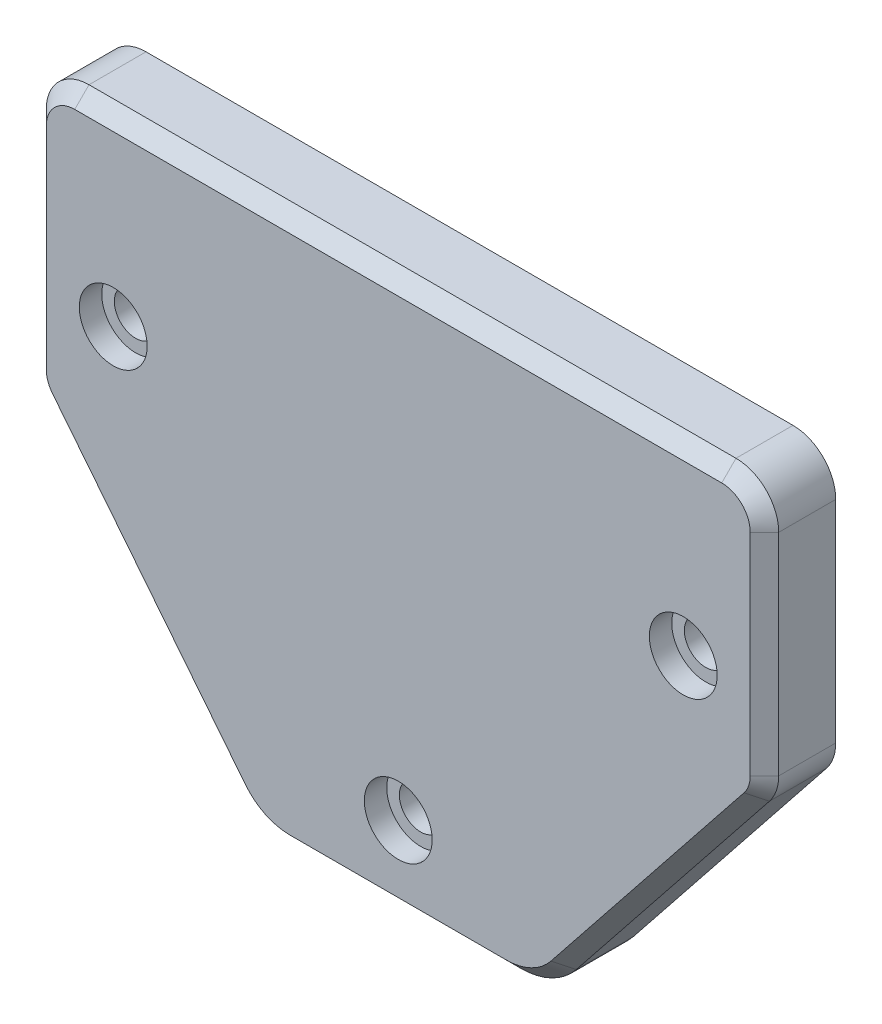
ISO-10303-21;
HEADER;
FILE_DESCRIPTION(('STEP AP214'),'2;1');
FILE_NAME('part.step','',(''),(''),'','','');
FILE_SCHEMA(('AUTOMOTIVE_DESIGN { 1 0 10303 214 1 1 1 1 }'));
ENDSEC;
DATA;
#1=APPLICATION_CONTEXT('core data for automotive mechanical design processes');
#2=APPLICATION_PROTOCOL_DEFINITION('international standard','automotive_design',2000,#1);
#3=PRODUCT_CONTEXT('',#1,'mechanical');
#4=PRODUCT('Part','Part','',(#3));
#5=PRODUCT_RELATED_PRODUCT_CATEGORY('part','',(#4));
#6=PRODUCT_DEFINITION_FORMATION('','',#4);
#7=PRODUCT_DEFINITION_CONTEXT('part definition',#1,'design');
#8=PRODUCT_DEFINITION('design','',#6,#7);
#9=PRODUCT_DEFINITION_SHAPE('','',#8);
#10=(LENGTH_UNIT() NAMED_UNIT(*) SI_UNIT(.MILLI.,.METRE.));
#11=(NAMED_UNIT(*) PLANE_ANGLE_UNIT() SI_UNIT($,.RADIAN.));
#12=(NAMED_UNIT(*) SI_UNIT($,.STERADIAN.) SOLID_ANGLE_UNIT());
#13=UNCERTAINTY_MEASURE_WITH_UNIT(LENGTH_MEASURE(1.E-05),#10,'distance_accuracy_value','');
#14=(GEOMETRIC_REPRESENTATION_CONTEXT(3) GLOBAL_UNCERTAINTY_ASSIGNED_CONTEXT((#13)) GLOBAL_UNIT_ASSIGNED_CONTEXT((#10,
#11,#12)) REPRESENTATION_CONTEXT('',''));
#15=CARTESIAN_POINT('',(0.,0.,0.));
#16=DIRECTION('',(0.,0.,1.));
#17=DIRECTION('',(1.,0.,0.));
#18=AXIS2_PLACEMENT_3D('',#15,#16,#17);
#19=CARTESIAN_POINT('',(-22.7,9.85,5.));
#20=DIRECTION('',(0.,0.,1.));
#21=DIRECTION('',(1.,0.,0.));
#22=AXIS2_PLACEMENT_3D('',#19,#20,#21);
#23=PLANE('',#22);
#24=CARTESIAN_POINT('',(-20.,0.,5.));
#25=DIRECTION('',(0.,0.,1.));
#26=DIRECTION('',(1.,0.,0.));
#27=AXIS2_PLACEMENT_3D('',#24,#25,#26);
#28=CIRCLE('',#27,2.38125);
#29=CARTESIAN_POINT('',(-17.61875,0.,5.));
#30=VERTEX_POINT('',#29);
#31=EDGE_CURVE('E698',#30,#30,#28,.T.);
#32=ORIENTED_EDGE('',*,*,#31,.F.);
#33=EDGE_LOOP('',(#32));
#34=FACE_BOUND('',#33,.T.);
#35=CARTESIAN_POINT('',(20.,0.,5.));
#36=DIRECTION('',(0.,0.,1.));
#37=DIRECTION('',(1.,0.,0.));
#38=AXIS2_PLACEMENT_3D('',#35,#36,#37);
#39=CIRCLE('',#38,2.38125);
#40=CARTESIAN_POINT('',(22.38125,0.,5.));
#41=VERTEX_POINT('',#40);
#42=EDGE_CURVE('E395',#41,#41,#39,.T.);
#43=ORIENTED_EDGE('',*,*,#42,.F.);
#44=EDGE_LOOP('',(#43));
#45=FACE_BOUND('',#44,.T.);
#46=CARTESIAN_POINT('',(0.,-20.,5.));
#47=DIRECTION('',(0.,0.,1.));
#48=DIRECTION('',(1.,0.,0.));
#49=AXIS2_PLACEMENT_3D('',#46,#47,#48);
#50=CIRCLE('',#49,2.38125);
#51=CARTESIAN_POINT('',(2.38125,-20.,5.));
#52=VERTEX_POINT('',#51);
#53=EDGE_CURVE('E390',#52,#52,#50,.T.);
#54=ORIENTED_EDGE('',*,*,#53,.F.);
#55=EDGE_LOOP('',(#54));
#56=FACE_BOUND('',#55,.T.);
#57=DIRECTION('',(0.623241640755491,0.782029319928865,0.));
#58=VECTOR('',#57,1.);
#59=CARTESIAN_POINT('',(24.2640586398577,-6.19727219314287,5.));
#60=LINE('',#59,#58);
#61=CARTESIAN_POINT('',(10.7192666801064,-23.192966563022,5.));
#62=VERTEX_POINT('',#61);
#63=CARTESIAN_POINT('',(24.2640586398577,-6.19727219314287,5.));
#64=VERTEX_POINT('',#63);
#65=EDGE_CURVE('E301',#62,#64,#60,.T.);
#66=ORIENTED_EDGE('',*,*,#65,.T.);
#67=CARTESIAN_POINT('',(22.7,-4.95078891163188,5.));
#68=DIRECTION('',(0.,0.,1.));
#69=DIRECTION('',(1.,0.,0.));
#70=AXIS2_PLACEMENT_3D('',#67,#68,#69);
#71=CIRCLE('',#70,2.00000000000001);
#72=CARTESIAN_POINT('',(24.7,-4.95078891163187,5.));
#73=VERTEX_POINT('',#72);
#74=EDGE_CURVE('E304',#64,#73,#71,.T.);
#75=ORIENTED_EDGE('',*,*,#74,.T.);
#76=DIRECTION('',(0.,1.,0.));
#77=VECTOR('',#76,1.);
#78=CARTESIAN_POINT('',(24.7,9.84999999999998,5.));
#79=LINE('',#78,#77);
#80=CARTESIAN_POINT('',(24.7,9.84999999999998,5.));
#81=VERTEX_POINT('',#80);
#82=EDGE_CURVE('E277',#73,#81,#79,.T.);
#83=ORIENTED_EDGE('',*,*,#82,.T.);
#84=CARTESIAN_POINT('',(22.7,9.85,5.));
#85=DIRECTION('',(0.,0.,1.));
#86=DIRECTION('',(1.,0.,0.));
#87=AXIS2_PLACEMENT_3D('',#84,#85,#86);
#88=CIRCLE('',#87,2.00000000000001);
#89=CARTESIAN_POINT('',(22.7,11.85,5.));
#90=VERTEX_POINT('',#89);
#91=EDGE_CURVE('E274',#81,#90,#88,.T.);
#92=ORIENTED_EDGE('',*,*,#91,.T.);
#93=DIRECTION('',(-1.,0.,0.));
#94=VECTOR('',#93,1.);
#95=CARTESIAN_POINT('',(-22.7,11.85,5.));
#96=LINE('',#95,#94);
#97=CARTESIAN_POINT('',(-22.7,11.85,5.));
#98=VERTEX_POINT('',#97);
#99=EDGE_CURVE('E178',#90,#98,#96,.T.);
#100=ORIENTED_EDGE('',*,*,#99,.T.);
#101=CARTESIAN_POINT('',(-22.7,9.85,5.));
#102=DIRECTION('',(0.,0.,1.));
#103=DIRECTION('',(1.,0.,0.));
#104=AXIS2_PLACEMENT_3D('',#101,#102,#103);
#105=CIRCLE('',#104,2.00000000000001);
#106=CARTESIAN_POINT('',(-24.7,9.84999999999998,5.));
#107=VERTEX_POINT('',#106);
#108=EDGE_CURVE('E280',#98,#107,#105,.T.);
#109=ORIENTED_EDGE('',*,*,#108,.T.);
#110=DIRECTION('',(0.,-1.,0.));
#111=VECTOR('',#110,1.);
#112=CARTESIAN_POINT('',(-24.7,-4.95078891163188,5.));
#113=LINE('',#112,#111);
#114=CARTESIAN_POINT('',(-24.7,-4.95078891163188,5.));
#115=VERTEX_POINT('',#114);
#116=EDGE_CURVE('E283',#107,#115,#113,.T.);
#117=ORIENTED_EDGE('',*,*,#116,.T.);
#118=CARTESIAN_POINT('',(-22.7,-4.95078891163188,5.));
#119=DIRECTION('',(0.,0.,1.));
#120=DIRECTION('',(1.,0.,0.));
#121=AXIS2_PLACEMENT_3D('',#118,#119,#120);
#122=CIRCLE('',#121,2.00000000000001);
#123=CARTESIAN_POINT('',(-24.2640586398577,-6.19727219314287,5.));
#124=VERTEX_POINT('',#123);
#125=EDGE_CURVE('E286',#115,#124,#122,.T.);
#126=ORIENTED_EDGE('',*,*,#125,.T.);
#127=DIRECTION('',(0.623241640755491,-0.782029319928865,0.));
#128=VECTOR('',#127,1.);
#129=CARTESIAN_POINT('',(-10.7192666801064,-23.1929665630219,5.));
#130=LINE('',#129,#128);
#131=CARTESIAN_POINT('',(-10.7192666801064,-23.1929665630219,5.));
#132=VERTEX_POINT('',#131);
#133=EDGE_CURVE('E289',#124,#132,#130,.T.);
#134=ORIENTED_EDGE('',*,*,#133,.T.);
#135=CARTESIAN_POINT('',(-7.59114940039091,-20.7,5.));
#136=DIRECTION('',(0.,0.,1.));
#137=DIRECTION('',(1.,0.,0.));
#138=AXIS2_PLACEMENT_3D('',#135,#136,#137);
#139=CIRCLE('',#138,4.00000000000001);
#140=CARTESIAN_POINT('',(-7.5911494003909,-24.7,5.));
#141=VERTEX_POINT('',#140);
#142=EDGE_CURVE('E292',#132,#141,#139,.T.);
#143=ORIENTED_EDGE('',*,*,#142,.T.);
#144=DIRECTION('',(1.,0.,0.));
#145=VECTOR('',#144,1.);
#146=CARTESIAN_POINT('',(7.59114940039088,-24.7,5.));
#147=LINE('',#146,#145);
#148=CARTESIAN_POINT('',(7.59114940039088,-24.7,5.));
#149=VERTEX_POINT('',#148);
#150=EDGE_CURVE('E295',#141,#149,#147,.T.);
#151=ORIENTED_EDGE('',*,*,#150,.T.);
#152=CARTESIAN_POINT('',(7.59114940039091,-20.7,5.));
#153=DIRECTION('',(0.,0.,1.));
#154=DIRECTION('',(1.,0.,0.));
#155=AXIS2_PLACEMENT_3D('',#152,#153,#154);
#156=CIRCLE('',#155,4.00000000000001);
#157=EDGE_CURVE('E298',#149,#62,#156,.T.);
#158=ORIENTED_EDGE('',*,*,#157,.T.);
#159=EDGE_LOOP('',(#66,#75,#83,#92,#100,#109,#117,#126,#134,#143,#151,#158));
#160=FACE_BOUND('',#159,.T.);
#161=ADVANCED_FACE('F41',(#34,#45,#56,#160),#23,.T.);
#162=CARTESIAN_POINT('',(-22.7,9.85,0.));
#163=DIRECTION('',(0.,0.,1.));
#164=DIRECTION('',(1.,0.,0.));
#165=AXIS2_PLACEMENT_3D('',#162,#163,#164);
#166=PLANE('',#165);
#167=CARTESIAN_POINT('',(-22.7,9.85,0.));
#168=DIRECTION('',(0.,0.,1.));
#169=DIRECTION('',(1.,0.,0.));
#170=AXIS2_PLACEMENT_3D('',#167,#168,#169);
#171=CIRCLE('',#170,3.);
#172=CARTESIAN_POINT('',(-22.7,12.85,0.));
#173=VERTEX_POINT('',#172);
#174=CARTESIAN_POINT('',(-25.7,9.84999999999998,0.));
#175=VERTEX_POINT('',#174);
#176=EDGE_CURVE('E172',#173,#175,#171,.T.);
#177=ORIENTED_EDGE('',*,*,#176,.F.);
#178=DIRECTION('',(-1.,0.,0.));
#179=VECTOR('',#178,1.);
#180=CARTESIAN_POINT('',(0.,12.85,0.));
#181=LINE('',#180,#179);
#182=CARTESIAN_POINT('',(22.7,12.85,0.));
#183=VERTEX_POINT('',#182);
#184=EDGE_CURVE('E182',#183,#173,#181,.T.);
#185=ORIENTED_EDGE('',*,*,#184,.F.);
#186=CARTESIAN_POINT('',(22.7,9.85,0.));
#187=DIRECTION('',(0.,0.,1.));
#188=DIRECTION('',(-1.,0.,0.));
#189=AXIS2_PLACEMENT_3D('',#186,#187,#188);
#190=CIRCLE('',#189,3.);
#191=CARTESIAN_POINT('',(25.7,9.84999999999998,0.));
#192=VERTEX_POINT('',#191);
#193=EDGE_CURVE('E189',#192,#183,#190,.T.);
#194=ORIENTED_EDGE('',*,*,#193,.F.);
#195=DIRECTION('',(0.,1.,0.));
#196=VECTOR('',#195,1.);
#197=CARTESIAN_POINT('',(25.7,-4.95078891163186,0.));
#198=LINE('',#197,#196);
#199=CARTESIAN_POINT('',(25.7,-4.95078891163186,0.));
#200=VERTEX_POINT('',#199);
#201=EDGE_CURVE('E235',#200,#192,#198,.T.);
#202=ORIENTED_EDGE('',*,*,#201,.F.);
#203=CARTESIAN_POINT('',(22.7,-4.95078891163188,0.));
#204=DIRECTION('',(0.,0.,1.));
#205=DIRECTION('',(1.,0.,0.));
#206=AXIS2_PLACEMENT_3D('',#203,#204,#205);
#207=CIRCLE('',#206,3.);
#208=CARTESIAN_POINT('',(25.0460879597866,-6.82051383389836,0.));
#209=VERTEX_POINT('',#208);
#210=EDGE_CURVE('E231',#209,#200,#207,.T.);
#211=ORIENTED_EDGE('',*,*,#210,.F.);
#212=DIRECTION('',(0.623241640755491,0.782029319928865,0.));
#213=VECTOR('',#212,1.);
#214=CARTESIAN_POINT('',(11.5012960000352,-23.8162082037774,0.));
#215=LINE('',#214,#213);
#216=CARTESIAN_POINT('',(11.5012960000352,-23.8162082037774,0.));
#217=VERTEX_POINT('',#216);
#218=EDGE_CURVE('E227',#217,#209,#215,.T.);
#219=ORIENTED_EDGE('',*,*,#218,.F.);
#220=CARTESIAN_POINT('',(7.59114940039091,-20.7,0.));
#221=DIRECTION('',(0.,0.,1.));
#222=DIRECTION('',(-1.,0.,0.));
#223=AXIS2_PLACEMENT_3D('',#220,#221,#222);
#224=CIRCLE('',#223,5.);
#225=CARTESIAN_POINT('',(7.59114940039088,-25.7,0.));
#226=VERTEX_POINT('',#225);
#227=EDGE_CURVE('E223',#226,#217,#224,.T.);
#228=ORIENTED_EDGE('',*,*,#227,.F.);
#229=DIRECTION('',(1.,0.,0.));
#230=VECTOR('',#229,1.);
#231=CARTESIAN_POINT('',(-7.5911494003909,-25.7,0.));
#232=LINE('',#231,#230);
#233=CARTESIAN_POINT('',(-7.5911494003909,-25.7,0.));
#234=VERTEX_POINT('',#233);
#235=EDGE_CURVE('E219',#234,#226,#232,.T.);
#236=ORIENTED_EDGE('',*,*,#235,.F.);
#237=CARTESIAN_POINT('',(-7.59114940039091,-20.7,0.));
#238=DIRECTION('',(0.,0.,1.));
#239=DIRECTION('',(1.,0.,0.));
#240=AXIS2_PLACEMENT_3D('',#237,#238,#239);
#241=CIRCLE('',#240,5.);
#242=CARTESIAN_POINT('',(-11.5012960000353,-23.8162082037774,0.));
#243=VERTEX_POINT('',#242);
#244=EDGE_CURVE('E215',#243,#234,#241,.T.);
#245=ORIENTED_EDGE('',*,*,#244,.F.);
#246=DIRECTION('',(0.623241640755491,-0.782029319928865,0.));
#247=VECTOR('',#246,1.);
#248=CARTESIAN_POINT('',(-11.5012960000353,-23.8162082037774,0.));
#249=LINE('',#248,#247);
#250=CARTESIAN_POINT('',(-25.0460879597866,-6.82051383389836,0.));
#251=VERTEX_POINT('',#250);
#252=EDGE_CURVE('E211',#251,#243,#249,.T.);
#253=ORIENTED_EDGE('',*,*,#252,.F.);
#254=CARTESIAN_POINT('',(-22.7,-4.95078891163188,0.));
#255=DIRECTION('',(0.,0.,1.));
#256=DIRECTION('',(-1.,0.,0.));
#257=AXIS2_PLACEMENT_3D('',#254,#255,#256);
#258=CIRCLE('',#257,3.);
#259=CARTESIAN_POINT('',(-25.7,-4.95078891163188,0.));
#260=VERTEX_POINT('',#259);
#261=EDGE_CURVE('E201',#260,#251,#258,.T.);
#262=ORIENTED_EDGE('',*,*,#261,.F.);
#263=DIRECTION('',(0.,-1.,0.));
#264=VECTOR('',#263,1.);
#265=CARTESIAN_POINT('',(-25.7,-4.95078891163186,0.));
#266=LINE('',#265,#264);
#267=EDGE_CURVE('E195',#175,#260,#266,.T.);
#268=ORIENTED_EDGE('',*,*,#267,.F.);
#269=EDGE_LOOP('',(#177,#185,#194,#202,#211,#219,#228,#236,#245,#253,#262,#268));
#270=FACE_BOUND('',#269,.T.);
#271=CARTESIAN_POINT('',(-20.,0.,0.));
#272=DIRECTION('',(0.,0.,1.));
#273=DIRECTION('',(1.,0.,0.));
#274=AXIS2_PLACEMENT_3D('',#271,#272,#273);
#275=CIRCLE('',#274,1.5);
#276=CARTESIAN_POINT('',(-18.5,0.,0.));
#277=VERTEX_POINT('',#276);
#278=EDGE_CURVE('E197',#277,#277,#275,.T.);
#279=ORIENTED_EDGE('',*,*,#278,.T.);
#280=EDGE_LOOP('',(#279));
#281=FACE_BOUND('',#280,.T.);
#282=CARTESIAN_POINT('',(20.,0.,0.));
#283=DIRECTION('',(0.,0.,1.));
#284=DIRECTION('',(-1.,0.,0.));
#285=AXIS2_PLACEMENT_3D('',#282,#283,#284);
#286=CIRCLE('',#285,1.5);
#287=CARTESIAN_POINT('',(18.5,0.,0.));
#288=VERTEX_POINT('',#287);
#289=EDGE_CURVE('E204',#288,#288,#286,.T.);
#290=ORIENTED_EDGE('',*,*,#289,.T.);
#291=EDGE_LOOP('',(#290));
#292=FACE_BOUND('',#291,.T.);
#293=CARTESIAN_POINT('',(0.,-20.,0.));
#294=DIRECTION('',(0.,0.,1.));
#295=DIRECTION('',(1.,0.,0.));
#296=AXIS2_PLACEMENT_3D('',#293,#294,#295);
#297=CIRCLE('',#296,1.5);
#298=CARTESIAN_POINT('',(1.5,-20.,0.));
#299=VERTEX_POINT('',#298);
#300=EDGE_CURVE('E387',#299,#299,#297,.T.);
#301=ORIENTED_EDGE('',*,*,#300,.T.);
#302=EDGE_LOOP('',(#301));
#303=FACE_BOUND('',#302,.T.);
#304=ADVANCED_FACE('F191',(#270,#281,#292,#303),#166,.F.);
#305=CARTESIAN_POINT('',(-22.7,9.85,5.));
#306=DIRECTION('',(0.,0.,-1.));
#307=DIRECTION('',(-1.,0.,0.));
#308=AXIS2_PLACEMENT_3D('',#305,#306,#307);
#309=CYLINDRICAL_SURFACE('',#308,3.);
#310=DIRECTION('',(0.,0.,-1.));
#311=VECTOR('',#310,1.);
#312=CARTESIAN_POINT('',(-25.7,9.84999999999998,5.));
#313=LINE('',#312,#311);
#314=CARTESIAN_POINT('',(-25.7,9.84999999999998,4.00000000000001));
#315=VERTEX_POINT('',#314);
#316=EDGE_CURVE('E179',#315,#175,#313,.T.);
#317=ORIENTED_EDGE('',*,*,#316,.F.);
#318=CARTESIAN_POINT('',(-22.7,9.85,4.00000000000001));
#319=DIRECTION('',(0.,0.,1.));
#320=DIRECTION('',(1.,0.,0.));
#321=AXIS2_PLACEMENT_3D('',#318,#319,#320);
#322=CIRCLE('',#321,3.);
#323=CARTESIAN_POINT('',(-22.7,12.85,4.00000000000001));
#324=VERTEX_POINT('',#323);
#325=EDGE_CURVE('E175',#315,#324,#322,.F.);
#326=ORIENTED_EDGE('',*,*,#325,.T.);
#327=DIRECTION('',(0.,0.,-1.));
#328=VECTOR('',#327,1.);
#329=CARTESIAN_POINT('',(-22.7,12.85,5.));
#330=LINE('',#329,#328);
#331=EDGE_CURVE('E167',#324,#173,#330,.T.);
#332=ORIENTED_EDGE('',*,*,#331,.T.);
#333=ORIENTED_EDGE('',*,*,#176,.T.);
#334=EDGE_LOOP('',(#317,#326,#332,#333));
#335=FACE_BOUND('',#334,.T.);
#336=ADVANCED_FACE('F170',(#335),#309,.T.);
#337=CARTESIAN_POINT('',(-25.7,-4.95078891163186,5.));
#338=DIRECTION('',(1.,0.,0.));
#339=DIRECTION('',(0.,0.,-1.));
#340=AXIS2_PLACEMENT_3D('',#337,#338,#339);
#341=PLANE('',#340);
#342=DIRECTION('',(0.,0.,-1.));
#343=VECTOR('',#342,1.);
#344=CARTESIAN_POINT('',(-25.7,-4.95078891163188,5.));
#345=LINE('',#344,#343);
#346=CARTESIAN_POINT('',(-25.7,-4.95078891163188,4.00000000000001));
#347=VERTEX_POINT('',#346);
#348=EDGE_CURVE('E267',#347,#260,#345,.T.);
#349=ORIENTED_EDGE('',*,*,#348,.F.);
#350=DIRECTION('',(0.,1.,0.));
#351=VECTOR('',#350,1.);
#352=CARTESIAN_POINT('',(-25.7,9.84999999999998,4.00000000000001));
#353=LINE('',#352,#351);
#354=EDGE_CURVE('E330',#347,#315,#353,.T.);
#355=ORIENTED_EDGE('',*,*,#354,.T.);
#356=ORIENTED_EDGE('',*,*,#316,.T.);
#357=ORIENTED_EDGE('',*,*,#267,.T.);
#358=EDGE_LOOP('',(#349,#355,#356,#357));
#359=FACE_BOUND('',#358,.T.);
#360=ADVANCED_FACE('F483',(#359),#341,.F.);
#361=CARTESIAN_POINT('',(-22.7,-4.95078891163188,5.));
#362=DIRECTION('',(0.,0.,-1.));
#363=DIRECTION('',(-1.,0.,0.));
#364=AXIS2_PLACEMENT_3D('',#361,#362,#363);
#365=CYLINDRICAL_SURFACE('',#364,3.);
#366=DIRECTION('',(0.,0.,-1.));
#367=VECTOR('',#366,1.);
#368=CARTESIAN_POINT('',(-25.0460879597866,-6.82051383389836,5.));
#369=LINE('',#368,#367);
#370=CARTESIAN_POINT('',(-25.0460879597866,-6.82051383389836,4.00000000000001));
#371=VERTEX_POINT('',#370);
#372=EDGE_CURVE('E264',#371,#251,#369,.T.);
#373=ORIENTED_EDGE('',*,*,#372,.F.);
#374=CARTESIAN_POINT('',(-22.7,-4.95078891163188,4.00000000000001));
#375=DIRECTION('',(0.,0.,1.));
#376=DIRECTION('',(1.,0.,0.));
#377=AXIS2_PLACEMENT_3D('',#374,#375,#376);
#378=CIRCLE('',#377,3.);
#379=EDGE_CURVE('E327',#371,#347,#378,.F.);
#380=ORIENTED_EDGE('',*,*,#379,.T.);
#381=ORIENTED_EDGE('',*,*,#348,.T.);
#382=ORIENTED_EDGE('',*,*,#261,.T.);
#383=EDGE_LOOP('',(#373,#380,#381,#382));
#384=FACE_BOUND('',#383,.T.);
#385=ADVANCED_FACE('F479',(#384),#365,.T.);
#386=CARTESIAN_POINT('',(-11.5012960000353,-23.8162082037774,5.));
#387=DIRECTION('',(0.782029319928865,0.623241640755491,0.));
#388=DIRECTION('',(-0.623241640755491,0.782029319928865,0.));
#389=AXIS2_PLACEMENT_3D('',#386,#387,#388);
#390=PLANE('',#389);
#391=DIRECTION('',(0.,0.,-1.));
#392=VECTOR('',#391,1.);
#393=CARTESIAN_POINT('',(-11.5012960000353,-23.8162082037774,5.));
#394=LINE('',#393,#392);
#395=CARTESIAN_POINT('',(-11.5012960000353,-23.8162082037774,4.00000000000001));
#396=VERTEX_POINT('',#395);
#397=EDGE_CURVE('E261',#396,#243,#394,.T.);
#398=ORIENTED_EDGE('',*,*,#397,.F.);
#399=DIRECTION('',(-0.623241640755491,0.782029319928865,0.));
#400=VECTOR('',#399,1.);
#401=CARTESIAN_POINT('',(-25.0460879597866,-6.82051383389836,4.00000000000001));
#402=LINE('',#401,#400);
#403=EDGE_CURVE('E324',#396,#371,#402,.T.);
#404=ORIENTED_EDGE('',*,*,#403,.T.);
#405=ORIENTED_EDGE('',*,*,#372,.T.);
#406=ORIENTED_EDGE('',*,*,#252,.T.);
#407=EDGE_LOOP('',(#398,#404,#405,#406));
#408=FACE_BOUND('',#407,.T.);
#409=ADVANCED_FACE('F475',(#408),#390,.F.);
#410=CARTESIAN_POINT('',(-7.59114940039091,-20.7,5.));
#411=DIRECTION('',(0.,0.,-1.));
#412=DIRECTION('',(-1.,0.,0.));
#413=AXIS2_PLACEMENT_3D('',#410,#411,#412);
#414=CYLINDRICAL_SURFACE('',#413,5.);
#415=DIRECTION('',(0.,0.,-1.));
#416=VECTOR('',#415,1.);
#417=CARTESIAN_POINT('',(-7.5911494003909,-25.7,5.));
#418=LINE('',#417,#416);
#419=CARTESIAN_POINT('',(-7.5911494003909,-25.7,4.00000000000001));
#420=VERTEX_POINT('',#419);
#421=EDGE_CURVE('E258',#420,#234,#418,.T.);
#422=ORIENTED_EDGE('',*,*,#421,.F.);
#423=CARTESIAN_POINT('',(-7.59114940039091,-20.7,4.00000000000001));
#424=DIRECTION('',(0.,0.,1.));
#425=DIRECTION('',(1.,0.,0.));
#426=AXIS2_PLACEMENT_3D('',#423,#424,#425);
#427=CIRCLE('',#426,5.);
#428=EDGE_CURVE('E321',#420,#396,#427,.F.);
#429=ORIENTED_EDGE('',*,*,#428,.T.);
#430=ORIENTED_EDGE('',*,*,#397,.T.);
#431=ORIENTED_EDGE('',*,*,#244,.T.);
#432=EDGE_LOOP('',(#422,#429,#430,#431));
#433=FACE_BOUND('',#432,.T.);
#434=ADVANCED_FACE('F471',(#433),#414,.T.);
#435=CARTESIAN_POINT('',(-7.5911494003909,-25.7,5.));
#436=DIRECTION('',(0.,1.,0.));
#437=DIRECTION('',(-1.,0.,0.));
#438=AXIS2_PLACEMENT_3D('',#435,#436,#437);
#439=PLANE('',#438);
#440=DIRECTION('',(0.,0.,-1.));
#441=VECTOR('',#440,1.);
#442=CARTESIAN_POINT('',(7.59114940039088,-25.7,5.));
#443=LINE('',#442,#441);
#444=CARTESIAN_POINT('',(7.59114940039088,-25.7,4.00000000000001));
#445=VERTEX_POINT('',#444);
#446=EDGE_CURVE('E255',#445,#226,#443,.T.);
#447=ORIENTED_EDGE('',*,*,#446,.F.);
#448=DIRECTION('',(-1.,0.,0.));
#449=VECTOR('',#448,1.);
#450=CARTESIAN_POINT('',(-7.5911494003909,-25.7,4.00000000000001));
#451=LINE('',#450,#449);
#452=EDGE_CURVE('E318',#445,#420,#451,.T.);
#453=ORIENTED_EDGE('',*,*,#452,.T.);
#454=ORIENTED_EDGE('',*,*,#421,.T.);
#455=ORIENTED_EDGE('',*,*,#235,.T.);
#456=EDGE_LOOP('',(#447,#453,#454,#455));
#457=FACE_BOUND('',#456,.T.);
#458=ADVANCED_FACE('F467',(#457),#439,.F.);
#459=CARTESIAN_POINT('',(7.59114940039091,-20.7,5.));
#460=DIRECTION('',(0.,0.,-1.));
#461=DIRECTION('',(-1.,0.,0.));
#462=AXIS2_PLACEMENT_3D('',#459,#460,#461);
#463=CYLINDRICAL_SURFACE('',#462,5.);
#464=DIRECTION('',(0.,0.,-1.));
#465=VECTOR('',#464,1.);
#466=CARTESIAN_POINT('',(11.5012960000352,-23.8162082037774,5.));
#467=LINE('',#466,#465);
#468=CARTESIAN_POINT('',(11.5012960000352,-23.8162082037774,4.00000000000001));
#469=VERTEX_POINT('',#468);
#470=EDGE_CURVE('E252',#469,#217,#467,.T.);
#471=ORIENTED_EDGE('',*,*,#470,.F.);
#472=CARTESIAN_POINT('',(7.59114940039091,-20.7,4.00000000000001));
#473=DIRECTION('',(0.,0.,1.));
#474=DIRECTION('',(1.,0.,0.));
#475=AXIS2_PLACEMENT_3D('',#472,#473,#474);
#476=CIRCLE('',#475,5.);
#477=EDGE_CURVE('E315',#469,#445,#476,.F.);
#478=ORIENTED_EDGE('',*,*,#477,.T.);
#479=ORIENTED_EDGE('',*,*,#446,.T.);
#480=ORIENTED_EDGE('',*,*,#227,.T.);
#481=EDGE_LOOP('',(#471,#478,#479,#480));
#482=FACE_BOUND('',#481,.T.);
#483=ADVANCED_FACE('F463',(#482),#463,.T.);
#484=CARTESIAN_POINT('',(11.5012960000352,-23.8162082037774,5.));
#485=DIRECTION('',(-0.782029319928865,0.623241640755491,0.));
#486=DIRECTION('',(-0.623241640755491,-0.782029319928865,0.));
#487=AXIS2_PLACEMENT_3D('',#484,#485,#486);
#488=PLANE('',#487);
#489=DIRECTION('',(0.,0.,-1.));
#490=VECTOR('',#489,1.);
#491=CARTESIAN_POINT('',(25.0460879597866,-6.82051383389836,5.));
#492=LINE('',#491,#490);
#493=CARTESIAN_POINT('',(25.0460879597866,-6.82051383389836,4.00000000000001));
#494=VERTEX_POINT('',#493);
#495=EDGE_CURVE('E249',#494,#209,#492,.T.);
#496=ORIENTED_EDGE('',*,*,#495,.F.);
#497=DIRECTION('',(-0.623241640755491,-0.782029319928865,0.));
#498=VECTOR('',#497,1.);
#499=CARTESIAN_POINT('',(11.5012960000352,-23.8162082037774,4.00000000000001));
#500=LINE('',#499,#498);
#501=EDGE_CURVE('E312',#494,#469,#500,.T.);
#502=ORIENTED_EDGE('',*,*,#501,.T.);
#503=ORIENTED_EDGE('',*,*,#470,.T.);
#504=ORIENTED_EDGE('',*,*,#218,.T.);
#505=EDGE_LOOP('',(#496,#502,#503,#504));
#506=FACE_BOUND('',#505,.T.);
#507=ADVANCED_FACE('F459',(#506),#488,.F.);
#508=CARTESIAN_POINT('',(22.7,-4.95078891163188,5.));
#509=DIRECTION('',(0.,0.,-1.));
#510=DIRECTION('',(-1.,0.,0.));
#511=AXIS2_PLACEMENT_3D('',#508,#509,#510);
#512=CYLINDRICAL_SURFACE('',#511,3.);
#513=DIRECTION('',(0.,0.,-1.));
#514=VECTOR('',#513,1.);
#515=CARTESIAN_POINT('',(25.7,-4.95078891163186,5.));
#516=LINE('',#515,#514);
#517=CARTESIAN_POINT('',(25.7,-4.95078891163186,4.00000000000001));
#518=VERTEX_POINT('',#517);
#519=EDGE_CURVE('E246',#518,#200,#516,.T.);
#520=ORIENTED_EDGE('',*,*,#519,.F.);
#521=CARTESIAN_POINT('',(22.7,-4.95078891163188,4.00000000000001));
#522=DIRECTION('',(0.,0.,1.));
#523=DIRECTION('',(1.,0.,0.));
#524=AXIS2_PLACEMENT_3D('',#521,#522,#523);
#525=CIRCLE('',#524,3.);
#526=EDGE_CURVE('E308',#518,#494,#525,.F.);
#527=ORIENTED_EDGE('',*,*,#526,.T.);
#528=ORIENTED_EDGE('',*,*,#495,.T.);
#529=ORIENTED_EDGE('',*,*,#210,.T.);
#530=EDGE_LOOP('',(#520,#527,#528,#529));
#531=FACE_BOUND('',#530,.T.);
#532=ADVANCED_FACE('F455',(#531),#512,.T.);
#533=CARTESIAN_POINT('',(25.7,-4.95078891163186,5.));
#534=DIRECTION('',(-1.,0.,0.));
#535=DIRECTION('',(0.,0.,1.));
#536=AXIS2_PLACEMENT_3D('',#533,#534,#535);
#537=PLANE('',#536);
#538=DIRECTION('',(0.,0.,-1.));
#539=VECTOR('',#538,1.);
#540=CARTESIAN_POINT('',(25.7,9.84999999999998,5.));
#541=LINE('',#540,#539);
#542=CARTESIAN_POINT('',(25.7,9.84999999999998,4.00000000000001));
#543=VERTEX_POINT('',#542);
#544=EDGE_CURVE('E243',#543,#192,#541,.T.);
#545=ORIENTED_EDGE('',*,*,#544,.F.);
#546=DIRECTION('',(0.,-1.,0.));
#547=VECTOR('',#546,1.);
#548=CARTESIAN_POINT('',(25.7,-4.95078891163186,4.00000000000001));
#549=LINE('',#548,#547);
#550=EDGE_CURVE('E335',#543,#518,#549,.T.);
#551=ORIENTED_EDGE('',*,*,#550,.T.);
#552=ORIENTED_EDGE('',*,*,#519,.T.);
#553=ORIENTED_EDGE('',*,*,#201,.T.);
#554=EDGE_LOOP('',(#545,#551,#552,#553));
#555=FACE_BOUND('',#554,.T.);
#556=ADVANCED_FACE('F452',(#555),#537,.F.);
#557=CARTESIAN_POINT('',(22.7,9.85,5.));
#558=DIRECTION('',(0.,0.,-1.));
#559=DIRECTION('',(-1.,0.,0.));
#560=AXIS2_PLACEMENT_3D('',#557,#558,#559);
#561=CYLINDRICAL_SURFACE('',#560,3.);
#562=DIRECTION('',(0.,0.,-1.));
#563=VECTOR('',#562,1.);
#564=CARTESIAN_POINT('',(22.7,12.85,5.));
#565=LINE('',#564,#563);
#566=CARTESIAN_POINT('',(22.7,12.85,4.00000000000001));
#567=VERTEX_POINT('',#566);
#568=EDGE_CURVE('E184',#567,#183,#565,.T.);
#569=ORIENTED_EDGE('',*,*,#568,.F.);
#570=CARTESIAN_POINT('',(22.7,9.85,4.00000000000001));
#571=DIRECTION('',(0.,0.,1.));
#572=DIRECTION('',(1.,0.,0.));
#573=AXIS2_PLACEMENT_3D('',#570,#571,#572);
#574=CIRCLE('',#573,3.);
#575=EDGE_CURVE('E52',#567,#543,#574,.F.);
#576=ORIENTED_EDGE('',*,*,#575,.T.);
#577=ORIENTED_EDGE('',*,*,#544,.T.);
#578=ORIENTED_EDGE('',*,*,#193,.T.);
#579=EDGE_LOOP('',(#569,#576,#577,#578));
#580=FACE_BOUND('',#579,.T.);
#581=ADVANCED_FACE('F449',(#580),#561,.T.);
#582=CARTESIAN_POINT('',(0.,12.85,5.));
#583=DIRECTION('',(0.,-1.,0.));
#584=DIRECTION('',(1.,0.,0.));
#585=AXIS2_PLACEMENT_3D('',#582,#583,#584);
#586=PLANE('',#585);
#587=ORIENTED_EDGE('',*,*,#331,.F.);
#588=DIRECTION('',(1.,0.,0.));
#589=VECTOR('',#588,1.);
#590=CARTESIAN_POINT('',(22.7,12.85,4.00000000000001));
#591=LINE('',#590,#589);
#592=EDGE_CURVE('E11',#324,#567,#591,.T.);
#593=ORIENTED_EDGE('',*,*,#592,.T.);
#594=ORIENTED_EDGE('',*,*,#568,.T.);
#595=ORIENTED_EDGE('',*,*,#184,.T.);
#596=EDGE_LOOP('',(#587,#593,#594,#595));
#597=FACE_BOUND('',#596,.T.);
#598=ADVANCED_FACE('F183',(#597),#586,.F.);
#599=CARTESIAN_POINT('',(-20.,0.,5.));
#600=DIRECTION('',(0.,0.,-1.));
#601=DIRECTION('',(-1.,0.,0.));
#602=AXIS2_PLACEMENT_3D('',#599,#600,#601);
#603=CYLINDRICAL_SURFACE('',#602,1.5);
#604=CARTESIAN_POINT('',(-20.,0.,3.4252));
#605=DIRECTION('',(0.,0.,-1.));
#606=DIRECTION('',(-1.,0.,0.));
#607=AXIS2_PLACEMENT_3D('',#604,#605,#606);
#608=CIRCLE('',#607,1.5);
#609=CARTESIAN_POINT('',(-21.5,0.,3.4252));
#610=VERTEX_POINT('',#609);
#611=EDGE_CURVE('E46',#610,#610,#608,.T.);
#612=ORIENTED_EDGE('',*,*,#611,.F.);
#613=EDGE_LOOP('',(#612));
#614=FACE_BOUND('',#613,.T.);
#615=ORIENTED_EDGE('',*,*,#278,.F.);
#616=EDGE_LOOP('',(#615));
#617=FACE_BOUND('',#616,.T.);
#618=ADVANCED_FACE('F426',(#614,#617),#603,.F.);
#619=CARTESIAN_POINT('',(20.,0.,5.));
#620=DIRECTION('',(0.,0.,-1.));
#621=DIRECTION('',(-1.,0.,0.));
#622=AXIS2_PLACEMENT_3D('',#619,#620,#621);
#623=CYLINDRICAL_SURFACE('',#622,1.5);
#624=CARTESIAN_POINT('',(20.,0.,3.4252));
#625=DIRECTION('',(0.,0.,-1.));
#626=DIRECTION('',(-1.,0.,0.));
#627=AXIS2_PLACEMENT_3D('',#624,#625,#626);
#628=CIRCLE('',#627,1.5);
#629=CARTESIAN_POINT('',(18.5,0.,3.4252));
#630=VERTEX_POINT('',#629);
#631=EDGE_CURVE('E391',#630,#630,#628,.T.);
#632=ORIENTED_EDGE('',*,*,#631,.F.);
#633=EDGE_LOOP('',(#632));
#634=FACE_BOUND('',#633,.T.);
#635=ORIENTED_EDGE('',*,*,#289,.F.);
#636=EDGE_LOOP('',(#635));
#637=FACE_BOUND('',#636,.T.);
#638=ADVANCED_FACE('F423',(#634,#637),#623,.F.);
#639=CARTESIAN_POINT('',(0.,-20.,5.));
#640=DIRECTION('',(0.,0.,-1.));
#641=DIRECTION('',(-1.,0.,0.));
#642=AXIS2_PLACEMENT_3D('',#639,#640,#641);
#643=CYLINDRICAL_SURFACE('',#642,1.5);
#644=CARTESIAN_POINT('',(0.,-20.,3.4252));
#645=DIRECTION('',(0.,0.,-1.));
#646=DIRECTION('',(-1.,0.,0.));
#647=AXIS2_PLACEMENT_3D('',#644,#645,#646);
#648=CIRCLE('',#647,1.5);
#649=CARTESIAN_POINT('',(-1.5,-20.,3.4252));
#650=VERTEX_POINT('',#649);
#651=EDGE_CURVE('E344',#650,#650,#648,.T.);
#652=ORIENTED_EDGE('',*,*,#651,.F.);
#653=EDGE_LOOP('',(#652));
#654=FACE_BOUND('',#653,.T.);
#655=ORIENTED_EDGE('',*,*,#300,.F.);
#656=EDGE_LOOP('',(#655));
#657=FACE_BOUND('',#656,.T.);
#658=ADVANCED_FACE('F425',(#654,#657),#643,.F.);
#659=CARTESIAN_POINT('',(-22.7,-4.95078891163188,5.));
#660=DIRECTION('',(0.,0.,-1.));
#661=DIRECTION('',(-1.,0.,0.));
#662=AXIS2_PLACEMENT_3D('',#659,#660,#661);
#663=CONICAL_SURFACE('',#662,2.00000000000001,0.785398163397448);
#664=DIRECTION('',(0.707106781186547,0.,0.707106781186547));
#665=VECTOR('',#664,1.);
#666=CARTESIAN_POINT('',(-25.7,-4.95078891163188,4.00000000000001));
#667=LINE('',#666,#665);
#668=EDGE_CURVE('E379',#347,#115,#667,.T.);
#669=ORIENTED_EDGE('',*,*,#668,.F.);
#670=ORIENTED_EDGE('',*,*,#379,.F.);
#671=DIRECTION('',(-0.552978235208405,-0.440698390496038,-0.707106781186547));
#672=VECTOR('',#671,1.);
#673=CARTESIAN_POINT('',(-24.2640586398577,-6.19727219314287,5.));
#674=LINE('',#673,#672);
#675=EDGE_CURVE('E383',#124,#371,#674,.T.);
#676=ORIENTED_EDGE('',*,*,#675,.F.);
#677=ORIENTED_EDGE('',*,*,#125,.F.);
#678=EDGE_LOOP('',(#669,#670,#676,#677));
#679=FACE_BOUND('',#678,.T.);
#680=ADVANCED_FACE('F44',(#679),#663,.T.);
#681=CARTESIAN_POINT('',(-31.4778630498275,2.85444416841157,5.));
#682=DIRECTION('',(-0.552978235208404,-0.440698390496037,0.707106781186549));
#683=DIRECTION('',(-0.623241640755491,0.782029319928865,0.));
#684=AXIS2_PLACEMENT_3D('',#681,#682,#683);
#685=PLANE('',#684);
#686=ORIENTED_EDGE('',*,*,#675,.T.);
#687=ORIENTED_EDGE('',*,*,#403,.F.);
#688=DIRECTION('',(-0.552978235208408,-0.440698390496037,-0.707106781186545));
#689=VECTOR('',#688,1.);
#690=CARTESIAN_POINT('',(-10.7192666801064,-23.1929665630219,5.));
#691=LINE('',#690,#689);
#692=EDGE_CURVE('E375',#132,#396,#691,.T.);
#693=ORIENTED_EDGE('',*,*,#692,.F.);
#694=ORIENTED_EDGE('',*,*,#133,.F.);
#695=EDGE_LOOP('',(#686,#687,#693,#694));
#696=FACE_BOUND('',#695,.T.);
#697=ADVANCED_FACE('F560',(#696),#685,.T.);
#698=CARTESIAN_POINT('',(-24.7,9.85,5.));
#699=DIRECTION('',(-0.707106781186547,0.,0.707106781186547));
#700=DIRECTION('',(0.,1.,0.));
#701=AXIS2_PLACEMENT_3D('',#698,#699,#700);
#702=PLANE('',#701);
#703=ORIENTED_EDGE('',*,*,#668,.T.);
#704=ORIENTED_EDGE('',*,*,#116,.F.);
#705=DIRECTION('',(0.707106781186547,0.,0.707106781186547));
#706=VECTOR('',#705,1.);
#707=CARTESIAN_POINT('',(-25.7,9.84999999999998,4.00000000000001));
#708=LINE('',#707,#706);
#709=EDGE_CURVE('E371',#315,#107,#708,.T.);
#710=ORIENTED_EDGE('',*,*,#709,.F.);
#711=ORIENTED_EDGE('',*,*,#354,.F.);
#712=EDGE_LOOP('',(#703,#704,#710,#711));
#713=FACE_BOUND('',#712,.T.);
#714=ADVANCED_FACE('F554',(#713),#702,.T.);
#715=CARTESIAN_POINT('',(-7.59114940039091,-20.7,5.));
#716=DIRECTION('',(0.,0.,-1.));
#717=DIRECTION('',(-1.,0.,0.));
#718=AXIS2_PLACEMENT_3D('',#715,#716,#717);
#719=CONICAL_SURFACE('',#718,4.00000000000001,0.785398163397448);
#720=ORIENTED_EDGE('',*,*,#692,.T.);
#721=ORIENTED_EDGE('',*,*,#428,.F.);
#722=DIRECTION('',(0.,-0.707106781186547,-0.707106781186547));
#723=VECTOR('',#722,1.);
#724=CARTESIAN_POINT('',(-7.5911494003909,-24.7,5.));
#725=LINE('',#724,#723);
#726=EDGE_CURVE('E367',#141,#420,#725,.T.);
#727=ORIENTED_EDGE('',*,*,#726,.F.);
#728=ORIENTED_EDGE('',*,*,#142,.F.);
#729=EDGE_LOOP('',(#720,#721,#727,#728));
#730=FACE_BOUND('',#729,.T.);
#731=ADVANCED_FACE('F547',(#730),#719,.T.);
#732=CARTESIAN_POINT('',(-22.7,9.85,5.));
#733=DIRECTION('',(0.,0.,-1.));
#734=DIRECTION('',(-1.,0.,0.));
#735=AXIS2_PLACEMENT_3D('',#732,#733,#734);
#736=CONICAL_SURFACE('',#735,2.00000000000001,0.785398163397448);
#737=ORIENTED_EDGE('',*,*,#709,.T.);
#738=ORIENTED_EDGE('',*,*,#108,.F.);
#739=DIRECTION('',(0.,-0.707106781186547,0.707106781186547));
#740=VECTOR('',#739,1.);
#741=CARTESIAN_POINT('',(-22.7,12.85,4.00000000000001));
#742=LINE('',#741,#740);
#743=EDGE_CURVE('E363',#324,#98,#742,.T.);
#744=ORIENTED_EDGE('',*,*,#743,.F.);
#745=ORIENTED_EDGE('',*,*,#325,.F.);
#746=EDGE_LOOP('',(#737,#738,#744,#745));
#747=FACE_BOUND('',#746,.T.);
#748=ADVANCED_FACE('F540',(#747),#736,.T.);
#749=CARTESIAN_POINT('',(-22.7,-24.7,5.));
#750=DIRECTION('',(0.,-0.707106781186549,0.707106781186546));
#751=DIRECTION('',(-1.,0.,0.));
#752=AXIS2_PLACEMENT_3D('',#749,#750,#751);
#753=PLANE('',#752);
#754=ORIENTED_EDGE('',*,*,#726,.T.);
#755=ORIENTED_EDGE('',*,*,#452,.F.);
#756=DIRECTION('',(0.,-0.707106781186546,-0.707106781186549));
#757=VECTOR('',#756,1.);
#758=CARTESIAN_POINT('',(7.59114940039088,-24.7,5.));
#759=LINE('',#758,#757);
#760=EDGE_CURVE('E359',#149,#445,#759,.T.);
#761=ORIENTED_EDGE('',*,*,#760,.F.);
#762=ORIENTED_EDGE('',*,*,#150,.F.);
#763=EDGE_LOOP('',(#754,#755,#761,#762));
#764=FACE_BOUND('',#763,.T.);
#765=ADVANCED_FACE('F533',(#764),#753,.T.);
#766=CARTESIAN_POINT('',(-22.7,11.85,5.));
#767=DIRECTION('',(0.,0.707106781186547,0.707106781186547));
#768=DIRECTION('',(1.,0.,0.));
#769=AXIS2_PLACEMENT_3D('',#766,#767,#768);
#770=PLANE('',#769);
#771=ORIENTED_EDGE('',*,*,#743,.T.);
#772=ORIENTED_EDGE('',*,*,#99,.F.);
#773=DIRECTION('',(0.,-0.707106781186547,0.707106781186547));
#774=VECTOR('',#773,1.);
#775=CARTESIAN_POINT('',(22.7,12.85,4.00000000000001));
#776=LINE('',#775,#774);
#777=EDGE_CURVE('E355',#567,#90,#776,.T.);
#778=ORIENTED_EDGE('',*,*,#777,.F.);
#779=ORIENTED_EDGE('',*,*,#592,.F.);
#780=EDGE_LOOP('',(#771,#772,#778,#779));
#781=FACE_BOUND('',#780,.T.);
#782=ADVANCED_FACE('F526',(#781),#770,.T.);
#783=CARTESIAN_POINT('',(7.59114940039091,-20.7,5.));
#784=DIRECTION('',(0.,0.,-1.));
#785=DIRECTION('',(-1.,0.,0.));
#786=AXIS2_PLACEMENT_3D('',#783,#784,#785);
#787=CONICAL_SURFACE('',#786,4.00000000000001,0.785398163397448);
#788=ORIENTED_EDGE('',*,*,#760,.T.);
#789=ORIENTED_EDGE('',*,*,#477,.F.);
#790=DIRECTION('',(0.552978235208404,-0.440698390496038,-0.707106781186548));
#791=VECTOR('',#790,1.);
#792=CARTESIAN_POINT('',(10.7192666801064,-23.192966563022,5.));
#793=LINE('',#792,#791);
#794=EDGE_CURVE('E351',#62,#469,#793,.T.);
#795=ORIENTED_EDGE('',*,*,#794,.F.);
#796=ORIENTED_EDGE('',*,*,#157,.F.);
#797=EDGE_LOOP('',(#788,#789,#795,#796));
#798=FACE_BOUND('',#797,.T.);
#799=ADVANCED_FACE('F519',(#798),#787,.T.);
#800=CARTESIAN_POINT('',(22.7,9.85,5.));
#801=DIRECTION('',(0.,0.,-1.));
#802=DIRECTION('',(-1.,0.,0.));
#803=AXIS2_PLACEMENT_3D('',#800,#801,#802);
#804=CONICAL_SURFACE('',#803,2.00000000000001,0.785398163397448);
#805=ORIENTED_EDGE('',*,*,#777,.T.);
#806=ORIENTED_EDGE('',*,*,#91,.F.);
#807=DIRECTION('',(-0.707106781186547,0.,0.707106781186547));
#808=VECTOR('',#807,1.);
#809=CARTESIAN_POINT('',(25.7,9.84999999999998,4.00000000000001));
#810=LINE('',#809,#808);
#811=EDGE_CURVE('E347',#543,#81,#810,.T.);
#812=ORIENTED_EDGE('',*,*,#811,.F.);
#813=ORIENTED_EDGE('',*,*,#575,.F.);
#814=EDGE_LOOP('',(#805,#806,#812,#813));
#815=FACE_BOUND('',#814,.T.);
#816=ADVANCED_FACE('F512',(#815),#804,.T.);
#817=CARTESIAN_POINT('',(13.843134567997,-19.2732087673885,5.));
#818=DIRECTION('',(0.552978235208404,-0.440698390496037,0.707106781186549));
#819=DIRECTION('',(-0.623241640755491,-0.782029319928865,0.));
#820=AXIS2_PLACEMENT_3D('',#817,#818,#819);
#821=PLANE('',#820);
#822=ORIENTED_EDGE('',*,*,#794,.T.);
#823=ORIENTED_EDGE('',*,*,#501,.F.);
#824=DIRECTION('',(0.552978235208403,-0.440698390496041,-0.707106781186547));
#825=VECTOR('',#824,1.);
#826=CARTESIAN_POINT('',(24.2640586398577,-6.19727219314287,5.));
#827=LINE('',#826,#825);
#828=EDGE_CURVE('E343',#64,#494,#827,.T.);
#829=ORIENTED_EDGE('',*,*,#828,.F.);
#830=ORIENTED_EDGE('',*,*,#65,.F.);
#831=EDGE_LOOP('',(#822,#823,#829,#830));
#832=FACE_BOUND('',#831,.T.);
#833=ADVANCED_FACE('F505',(#832),#821,.T.);
#834=CARTESIAN_POINT('',(24.7,9.85,5.));
#835=DIRECTION('',(0.707106781186549,0.,0.707106781186546));
#836=DIRECTION('',(0.,-1.,0.));
#837=AXIS2_PLACEMENT_3D('',#834,#835,#836);
#838=PLANE('',#837);
#839=ORIENTED_EDGE('',*,*,#811,.T.);
#840=ORIENTED_EDGE('',*,*,#82,.F.);
#841=DIRECTION('',(-0.707106781186546,0.,0.707106781186549));
#842=VECTOR('',#841,1.);
#843=CARTESIAN_POINT('',(25.7,-4.95078891163186,4.00000000000001));
#844=LINE('',#843,#842);
#845=EDGE_CURVE('E340',#518,#73,#844,.T.);
#846=ORIENTED_EDGE('',*,*,#845,.F.);
#847=ORIENTED_EDGE('',*,*,#550,.F.);
#848=EDGE_LOOP('',(#839,#840,#846,#847));
#849=FACE_BOUND('',#848,.T.);
#850=ADVANCED_FACE('F498',(#849),#838,.T.);
#851=CARTESIAN_POINT('',(22.7,-4.95078891163188,5.));
#852=DIRECTION('',(0.,0.,-1.));
#853=DIRECTION('',(-1.,0.,0.));
#854=AXIS2_PLACEMENT_3D('',#851,#852,#853);
#855=CONICAL_SURFACE('',#854,2.00000000000001,0.785398163397448);
#856=ORIENTED_EDGE('',*,*,#828,.T.);
#857=ORIENTED_EDGE('',*,*,#526,.F.);
#858=ORIENTED_EDGE('',*,*,#845,.T.);
#859=ORIENTED_EDGE('',*,*,#74,.F.);
#860=EDGE_LOOP('',(#856,#857,#858,#859));
#861=FACE_BOUND('',#860,.T.);
#862=ADVANCED_FACE('F491',(#861),#855,.T.);
#863=CARTESIAN_POINT('',(0.,-20.,5.));
#864=DIRECTION('',(0.,0.,1.));
#865=DIRECTION('',(1.,0.,0.));
#866=AXIS2_PLACEMENT_3D('',#863,#864,#865);
#867=CYLINDRICAL_SURFACE('',#866,2.38125);
#868=CARTESIAN_POINT('',(0.,-20.,3.4252));
#869=DIRECTION('',(0.,0.,1.));
#870=DIRECTION('',(1.,0.,0.));
#871=AXIS2_PLACEMENT_3D('',#868,#869,#870);
#872=CIRCLE('',#871,2.38125);
#873=CARTESIAN_POINT('',(2.38125,-20.,3.4252));
#874=VERTEX_POINT('',#873);
#875=EDGE_CURVE('E394',#874,#874,#872,.T.);
#876=ORIENTED_EDGE('',*,*,#875,.F.);
#877=EDGE_LOOP('',(#876));
#878=FACE_BOUND('',#877,.T.);
#879=ORIENTED_EDGE('',*,*,#53,.T.);
#880=EDGE_LOOP('',(#879));
#881=FACE_BOUND('',#880,.T.);
#882=ADVANCED_FACE('F497',(#878,#881),#867,.F.);
#883=CARTESIAN_POINT('',(2.38125,-20.,3.4252));
#884=DIRECTION('',(0.,0.,-1.));
#885=DIRECTION('',(-1.,0.,0.));
#886=AXIS2_PLACEMENT_3D('',#883,#884,#885);
#887=PLANE('',#886);
#888=ORIENTED_EDGE('',*,*,#651,.T.);
#889=EDGE_LOOP('',(#888));
#890=FACE_BOUND('',#889,.T.);
#891=ORIENTED_EDGE('',*,*,#875,.T.);
#892=EDGE_LOOP('',(#891));
#893=FACE_BOUND('',#892,.T.);
#894=ADVANCED_FACE('F637',(#890,#893),#887,.F.);
#895=CARTESIAN_POINT('',(20.,0.,5.));
#896=DIRECTION('',(0.,0.,1.));
#897=DIRECTION('',(1.,0.,0.));
#898=AXIS2_PLACEMENT_3D('',#895,#896,#897);
#899=CYLINDRICAL_SURFACE('',#898,2.38125);
#900=CARTESIAN_POINT('',(20.,0.,3.4252));
#901=DIRECTION('',(0.,0.,1.));
#902=DIRECTION('',(1.,0.,0.));
#903=AXIS2_PLACEMENT_3D('',#900,#901,#902);
#904=CIRCLE('',#903,2.38125);
#905=CARTESIAN_POINT('',(22.38125,0.,3.4252));
#906=VERTEX_POINT('',#905);
#907=EDGE_CURVE('E403',#906,#906,#904,.T.);
#908=ORIENTED_EDGE('',*,*,#907,.F.);
#909=EDGE_LOOP('',(#908));
#910=FACE_BOUND('',#909,.T.);
#911=ORIENTED_EDGE('',*,*,#42,.T.);
#912=EDGE_LOOP('',(#911));
#913=FACE_BOUND('',#912,.T.);
#914=ADVANCED_FACE('F648',(#910,#913),#899,.F.);
#915=CARTESIAN_POINT('',(22.38125,0.,3.4252));
#916=DIRECTION('',(0.,0.,-1.));
#917=DIRECTION('',(-1.,0.,0.));
#918=AXIS2_PLACEMENT_3D('',#915,#916,#917);
#919=PLANE('',#918);
#920=ORIENTED_EDGE('',*,*,#631,.T.);
#921=EDGE_LOOP('',(#920));
#922=FACE_BOUND('',#921,.T.);
#923=ORIENTED_EDGE('',*,*,#907,.T.);
#924=EDGE_LOOP('',(#923));
#925=FACE_BOUND('',#924,.T.);
#926=ADVANCED_FACE('F658',(#922,#925),#919,.F.);
#927=CARTESIAN_POINT('',(-20.,0.,5.));
#928=DIRECTION('',(0.,0.,1.));
#929=DIRECTION('',(1.,0.,0.));
#930=AXIS2_PLACEMENT_3D('',#927,#928,#929);
#931=CYLINDRICAL_SURFACE('',#930,2.38125);
#932=CARTESIAN_POINT('',(-20.,0.,3.4252));
#933=DIRECTION('',(0.,0.,1.));
#934=DIRECTION('',(1.,0.,0.));
#935=AXIS2_PLACEMENT_3D('',#932,#933,#934);
#936=CIRCLE('',#935,2.38125);
#937=CARTESIAN_POINT('',(-17.61875,0.,3.4252));
#938=VERTEX_POINT('',#937);
#939=EDGE_CURVE('E696',#938,#938,#936,.T.);
#940=ORIENTED_EDGE('',*,*,#939,.F.);
#941=EDGE_LOOP('',(#940));
#942=FACE_BOUND('',#941,.T.);
#943=ORIENTED_EDGE('',*,*,#31,.T.);
#944=EDGE_LOOP('',(#943));
#945=FACE_BOUND('',#944,.T.);
#946=ADVANCED_FACE('F668',(#942,#945),#931,.F.);
#947=CARTESIAN_POINT('',(-17.61875,0.,3.4252));
#948=DIRECTION('',(0.,0.,-1.));
#949=DIRECTION('',(-1.,0.,0.));
#950=AXIS2_PLACEMENT_3D('',#947,#948,#949);
#951=PLANE('',#950);
#952=ORIENTED_EDGE('',*,*,#611,.T.);
#953=EDGE_LOOP('',(#952));
#954=FACE_BOUND('',#953,.T.);
#955=ORIENTED_EDGE('',*,*,#939,.T.);
#956=EDGE_LOOP('',(#955));
#957=FACE_BOUND('',#956,.T.);
#958=ADVANCED_FACE('F677',(#954,#957),#951,.F.);
#959=CLOSED_SHELL('',(#161,#304,#336,#360,#385,#409,#434,#458,#483,#507,#532,#556,#581,#598,
#618,#638,#658,#680,#697,#714,#731,#748,#765,#782,#799,#816,#833,#850,#862,#882,#894,#914,#926,
#946,#958));
#960=MANIFOLD_SOLID_BREP('B2',#959);
#961=ADVANCED_BREP_SHAPE_REPRESENTATION('',(#18,#960),#14);
#962=SHAPE_DEFINITION_REPRESENTATION(#9,#961);
ENDSEC;
END-ISO-10303-21;
